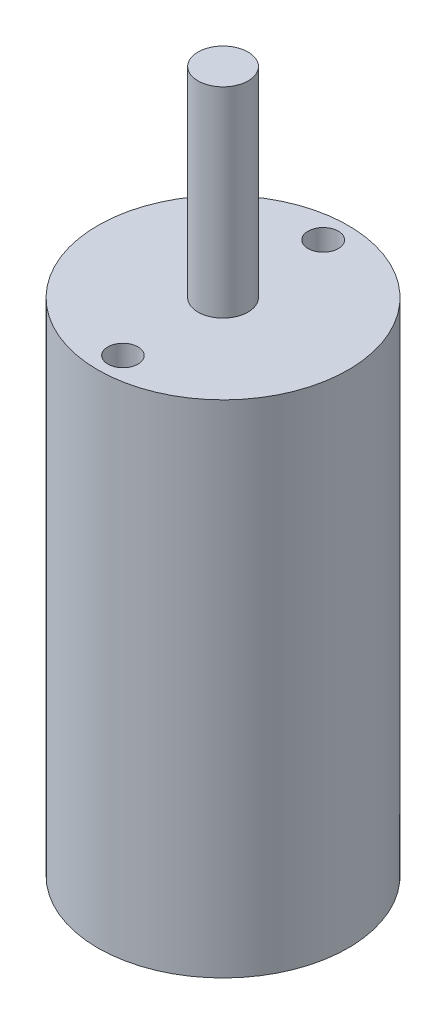
ISO-10303-21;
HEADER;
FILE_DESCRIPTION(('STEP AP214'),'2;1');
FILE_NAME('part.step','',(''),(''),'','','');
FILE_SCHEMA(('AUTOMOTIVE_DESIGN { 1 0 10303 214 1 1 1 1 }'));
ENDSEC;
DATA;
#1=APPLICATION_CONTEXT('core data for automotive mechanical design processes');
#2=APPLICATION_PROTOCOL_DEFINITION('international standard','automotive_design',2000,#1);
#3=PRODUCT_CONTEXT('',#1,'mechanical');
#4=PRODUCT('Part','Part','',(#3));
#5=PRODUCT_RELATED_PRODUCT_CATEGORY('part','',(#4));
#6=PRODUCT_DEFINITION_FORMATION('','',#4);
#7=PRODUCT_DEFINITION_CONTEXT('part definition',#1,'design');
#8=PRODUCT_DEFINITION('design','',#6,#7);
#9=PRODUCT_DEFINITION_SHAPE('','',#8);
#10=(LENGTH_UNIT() NAMED_UNIT(*) SI_UNIT(.MILLI.,.METRE.));
#11=(NAMED_UNIT(*) PLANE_ANGLE_UNIT() SI_UNIT($,.RADIAN.));
#12=(NAMED_UNIT(*) SI_UNIT($,.STERADIAN.) SOLID_ANGLE_UNIT());
#13=UNCERTAINTY_MEASURE_WITH_UNIT(LENGTH_MEASURE(1.E-05),#10,'distance_accuracy_value','');
#14=(GEOMETRIC_REPRESENTATION_CONTEXT(3) GLOBAL_UNCERTAINTY_ASSIGNED_CONTEXT((#13)) GLOBAL_UNIT_ASSIGNED_CONTEXT((#10,
#11,#12)) REPRESENTATION_CONTEXT('',''));
#15=CARTESIAN_POINT('',(0.,0.,0.));
#16=DIRECTION('',(0.,0.,1.));
#17=DIRECTION('',(1.,0.,0.));
#18=AXIS2_PLACEMENT_3D('',#15,#16,#17);
#19=CARTESIAN_POINT('',(0.,50.,0.));
#20=DIRECTION('',(0.,-1.,0.));
#21=DIRECTION('',(0.,0.,-1.));
#22=AXIS2_PLACEMENT_3D('',#19,#20,#21);
#23=CYLINDRICAL_SURFACE('',#22,12.5);
#24=CARTESIAN_POINT('',(0.,50.,0.));
#25=DIRECTION('',(0.,1.,0.));
#26=DIRECTION('',(0.,0.,1.));
#27=AXIS2_PLACEMENT_3D('',#24,#25,#26);
#28=CIRCLE('',#27,12.5);
#29=CARTESIAN_POINT('',(0.,50.,12.5));
#30=VERTEX_POINT('',#29);
#31=EDGE_CURVE('E10',#30,#30,#28,.T.);
#32=ORIENTED_EDGE('',*,*,#31,.F.);
#33=EDGE_LOOP('',(#32));
#34=FACE_BOUND('',#33,.T.);
#35=CARTESIAN_POINT('',(0.,0.,0.));
#36=DIRECTION('',(0.,1.,0.));
#37=DIRECTION('',(0.,0.,1.));
#38=AXIS2_PLACEMENT_3D('',#35,#36,#37);
#39=CIRCLE('',#38,12.5);
#40=CARTESIAN_POINT('',(0.,0.,12.5));
#41=VERTEX_POINT('',#40);
#42=EDGE_CURVE('E40',#41,#41,#39,.T.);
#43=ORIENTED_EDGE('',*,*,#42,.T.);
#44=EDGE_LOOP('',(#43));
#45=FACE_BOUND('',#44,.T.);
#46=ADVANCED_FACE('F37',(#34,#45),#23,.T.);
#47=CARTESIAN_POINT('',(0.,50.,0.));
#48=DIRECTION('',(0.,1.,0.));
#49=DIRECTION('',(0.,0.,1.));
#50=AXIS2_PLACEMENT_3D('',#47,#48,#49);
#51=PLANE('',#50);
#52=CARTESIAN_POINT('',(0.,50.,0.));
#53=DIRECTION('',(0.,1.,0.));
#54=DIRECTION('',(0.,0.,1.));
#55=AXIS2_PLACEMENT_3D('',#52,#53,#54);
#56=CIRCLE('',#55,2.5);
#57=CARTESIAN_POINT('',(0.,50.,2.5));
#58=VERTEX_POINT('',#57);
#59=EDGE_CURVE('E67',#58,#58,#56,.T.);
#60=ORIENTED_EDGE('',*,*,#59,.F.);
#61=EDGE_LOOP('',(#60));
#62=FACE_BOUND('',#61,.T.);
#63=CARTESIAN_POINT('',(0.,50.,10.));
#64=DIRECTION('',(0.,1.,0.));
#65=DIRECTION('',(0.,0.,1.));
#66=AXIS2_PLACEMENT_3D('',#63,#64,#65);
#67=CIRCLE('',#66,1.5);
#68=CARTESIAN_POINT('',(0.,50.,11.5));
#69=VERTEX_POINT('',#68);
#70=EDGE_CURVE('E60',#69,#69,#67,.T.);
#71=ORIENTED_EDGE('',*,*,#70,.F.);
#72=EDGE_LOOP('',(#71));
#73=FACE_BOUND('',#72,.T.);
#74=CARTESIAN_POINT('',(0.,50.,-10.));
#75=DIRECTION('',(0.,1.,0.));
#76=DIRECTION('',(0.,0.,1.));
#77=AXIS2_PLACEMENT_3D('',#74,#75,#76);
#78=CIRCLE('',#77,1.51236513149746);
#79=CARTESIAN_POINT('',(0.,50.,-8.48763486850254));
#80=VERTEX_POINT('',#79);
#81=EDGE_CURVE('E51',#80,#80,#78,.T.);
#82=ORIENTED_EDGE('',*,*,#81,.F.);
#83=EDGE_LOOP('',(#82));
#84=FACE_BOUND('',#83,.T.);
#85=ORIENTED_EDGE('',*,*,#31,.T.);
#86=EDGE_LOOP('',(#85));
#87=FACE_BOUND('',#86,.T.);
#88=ADVANCED_FACE('F84',(#62,#73,#84,#87),#51,.T.);
#89=CARTESIAN_POINT('',(0.,0.,0.));
#90=DIRECTION('',(0.,1.,0.));
#91=DIRECTION('',(0.,0.,1.));
#92=AXIS2_PLACEMENT_3D('',#89,#90,#91);
#93=PLANE('',#92);
#94=ORIENTED_EDGE('',*,*,#42,.F.);
#95=EDGE_LOOP('',(#94));
#96=FACE_BOUND('',#95,.T.);
#97=ADVANCED_FACE('F87',(#96),#93,.F.);
#98=CARTESIAN_POINT('',(0.,40.,-10.));
#99=DIRECTION('',(0.,1.,0.));
#100=DIRECTION('',(0.,0.,1.));
#101=AXIS2_PLACEMENT_3D('',#98,#99,#100);
#102=CYLINDRICAL_SURFACE('',#101,1.51236513149746);
#103=CARTESIAN_POINT('',(0.,40.,-10.));
#104=DIRECTION('',(0.,1.,0.));
#105=DIRECTION('',(0.,0.,1.));
#106=AXIS2_PLACEMENT_3D('',#103,#104,#105);
#107=CIRCLE('',#106,1.51236513149746);
#108=CARTESIAN_POINT('',(0.,40.,-8.48763486850254));
#109=VERTEX_POINT('',#108);
#110=EDGE_CURVE('E55',#109,#109,#107,.T.);
#111=ORIENTED_EDGE('',*,*,#110,.F.);
#112=EDGE_LOOP('',(#111));
#113=FACE_BOUND('',#112,.T.);
#114=ORIENTED_EDGE('',*,*,#81,.T.);
#115=EDGE_LOOP('',(#114));
#116=FACE_BOUND('',#115,.T.);
#117=ADVANCED_FACE('F93',(#113,#116),#102,.F.);
#118=CARTESIAN_POINT('',(0.,40.,-10.));
#119=DIRECTION('',(0.,1.,0.));
#120=DIRECTION('',(0.,0.,1.));
#121=AXIS2_PLACEMENT_3D('',#118,#119,#120);
#122=PLANE('',#121);
#123=ORIENTED_EDGE('',*,*,#110,.T.);
#124=EDGE_LOOP('',(#123));
#125=FACE_BOUND('',#124,.T.);
#126=ADVANCED_FACE('F95',(#125),#122,.T.);
#127=CARTESIAN_POINT('',(0.,40.,10.));
#128=DIRECTION('',(0.,1.,0.));
#129=DIRECTION('',(0.,0.,1.));
#130=AXIS2_PLACEMENT_3D('',#127,#128,#129);
#131=CYLINDRICAL_SURFACE('',#130,1.5);
#132=CARTESIAN_POINT('',(0.,40.,10.));
#133=DIRECTION('',(0.,1.,0.));
#134=DIRECTION('',(0.,0.,1.));
#135=AXIS2_PLACEMENT_3D('',#132,#133,#134);
#136=CIRCLE('',#135,1.5);
#137=CARTESIAN_POINT('',(0.,40.,11.5));
#138=VERTEX_POINT('',#137);
#139=EDGE_CURVE('E49',#138,#138,#136,.T.);
#140=ORIENTED_EDGE('',*,*,#139,.F.);
#141=EDGE_LOOP('',(#140));
#142=FACE_BOUND('',#141,.T.);
#143=ORIENTED_EDGE('',*,*,#70,.T.);
#144=EDGE_LOOP('',(#143));
#145=FACE_BOUND('',#144,.T.);
#146=ADVANCED_FACE('F102',(#142,#145),#131,.F.);
#147=CARTESIAN_POINT('',(0.,40.,10.));
#148=DIRECTION('',(0.,1.,0.));
#149=DIRECTION('',(0.,0.,1.));
#150=AXIS2_PLACEMENT_3D('',#147,#148,#149);
#151=PLANE('',#150);
#152=ORIENTED_EDGE('',*,*,#139,.T.);
#153=EDGE_LOOP('',(#152));
#154=FACE_BOUND('',#153,.T.);
#155=ADVANCED_FACE('F80',(#154),#151,.T.);
#156=CARTESIAN_POINT('',(0.,70.,0.));
#157=DIRECTION('',(0.,-1.,0.));
#158=DIRECTION('',(0.,0.,-1.));
#159=AXIS2_PLACEMENT_3D('',#156,#157,#158);
#160=CYLINDRICAL_SURFACE('',#159,2.5);
#161=CARTESIAN_POINT('',(0.,70.,0.));
#162=DIRECTION('',(0.,1.,0.));
#163=DIRECTION('',(0.,0.,1.));
#164=AXIS2_PLACEMENT_3D('',#161,#162,#163);
#165=CIRCLE('',#164,2.5);
#166=CARTESIAN_POINT('',(0.,70.,2.5));
#167=VERTEX_POINT('',#166);
#168=EDGE_CURVE('E56',#167,#167,#165,.T.);
#169=ORIENTED_EDGE('',*,*,#168,.F.);
#170=EDGE_LOOP('',(#169));
#171=FACE_BOUND('',#170,.T.);
#172=ORIENTED_EDGE('',*,*,#59,.T.);
#173=EDGE_LOOP('',(#172));
#174=FACE_BOUND('',#173,.T.);
#175=ADVANCED_FACE('F77',(#171,#174),#160,.T.);
#176=CARTESIAN_POINT('',(0.,70.,0.));
#177=DIRECTION('',(0.,1.,0.));
#178=DIRECTION('',(0.,0.,1.));
#179=AXIS2_PLACEMENT_3D('',#176,#177,#178);
#180=PLANE('',#179);
#181=ORIENTED_EDGE('',*,*,#168,.T.);
#182=EDGE_LOOP('',(#181));
#183=FACE_BOUND('',#182,.T.);
#184=ADVANCED_FACE('F75',(#183),#180,.T.);
#185=CLOSED_SHELL('',(#46,#88,#97,#117,#126,#146,#155,#175,#184));
#186=MANIFOLD_SOLID_BREP('B2',#185);
#187=ADVANCED_BREP_SHAPE_REPRESENTATION('',(#18,#186),#14);
#188=SHAPE_DEFINITION_REPRESENTATION(#9,#187);
ENDSEC;
END-ISO-10303-21;
